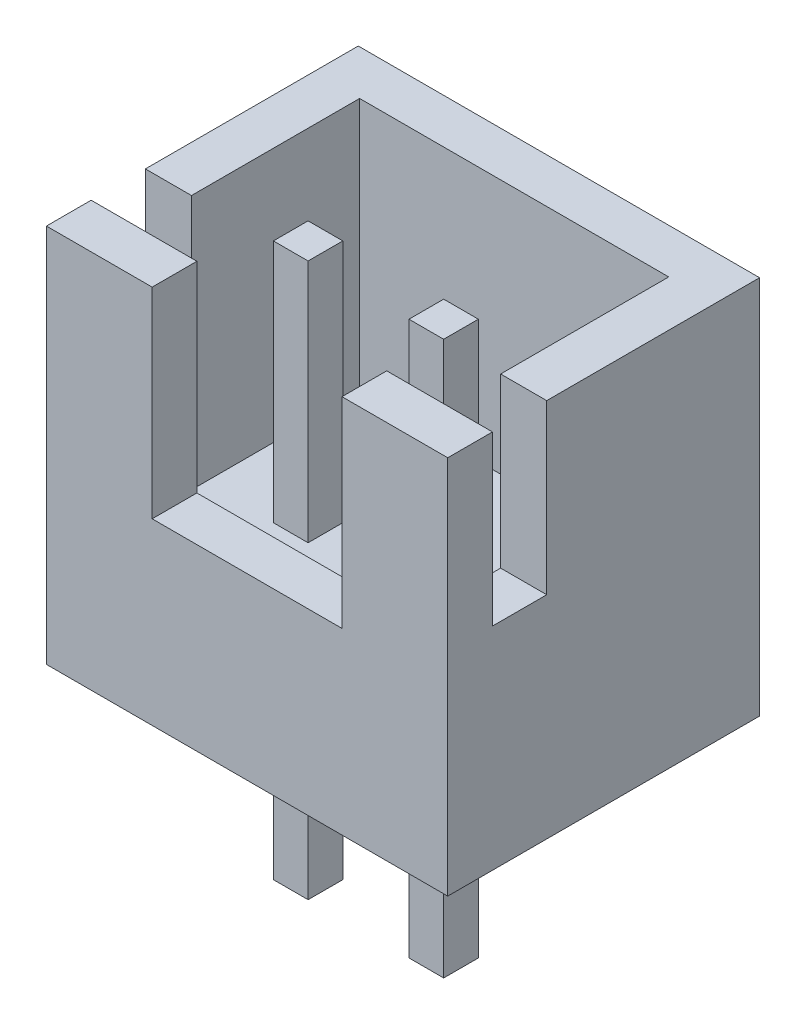
ISO-10303-21;
HEADER;
FILE_DESCRIPTION(('STEP AP214'),'2;1');
FILE_NAME('part.step','',(''),(''),'','','');
FILE_SCHEMA(('AUTOMOTIVE_DESIGN { 1 0 10303 214 1 1 1 1 }'));
ENDSEC;
DATA;
#1=APPLICATION_CONTEXT('core data for automotive mechanical design processes');
#2=APPLICATION_PROTOCOL_DEFINITION('international standard','automotive_design',2000,#1);
#3=PRODUCT_CONTEXT('',#1,'mechanical');
#4=PRODUCT('Part','Part','',(#3));
#5=PRODUCT_RELATED_PRODUCT_CATEGORY('part','',(#4));
#6=PRODUCT_DEFINITION_FORMATION('','',#4);
#7=PRODUCT_DEFINITION_CONTEXT('part definition',#1,'design');
#8=PRODUCT_DEFINITION('design','',#6,#7);
#9=PRODUCT_DEFINITION_SHAPE('','',#8);
#10=(LENGTH_UNIT() NAMED_UNIT(*) SI_UNIT(.MILLI.,.METRE.));
#11=(NAMED_UNIT(*) PLANE_ANGLE_UNIT() SI_UNIT($,.RADIAN.));
#12=(NAMED_UNIT(*) SI_UNIT($,.STERADIAN.) SOLID_ANGLE_UNIT());
#13=UNCERTAINTY_MEASURE_WITH_UNIT(LENGTH_MEASURE(1.E-05),#10,'distance_accuracy_value','');
#14=(GEOMETRIC_REPRESENTATION_CONTEXT(3) GLOBAL_UNCERTAINTY_ASSIGNED_CONTEXT((#13)) GLOBAL_UNIT_ASSIGNED_CONTEXT((#10,
#11,#12)) REPRESENTATION_CONTEXT('',''));
#15=CARTESIAN_POINT('',(0.,0.,0.));
#16=DIRECTION('',(0.,0.,1.));
#17=DIRECTION('',(1.,0.,0.));
#18=AXIS2_PLACEMENT_3D('',#15,#16,#17);
#19=CARTESIAN_POINT('',(0.93,7.705096679919,0.82));
#20=DIRECTION('',(0.,0.,-1.));
#21=DIRECTION('',(-1.,0.,0.));
#22=AXIS2_PLACEMENT_3D('',#19,#20,#21);
#23=PLANE('',#22);
#24=DIRECTION('',(-1.,0.,0.));
#25=VECTOR('',#24,1.);
#26=CARTESIAN_POINT('',(0.93,2.3,0.82));
#27=LINE('',#26,#25);
#28=CARTESIAN_POINT('',(1.57,2.3,0.82));
#29=VERTEX_POINT('',#28);
#30=CARTESIAN_POINT('',(0.93,2.3,0.82));
#31=VERTEX_POINT('',#30);
#32=EDGE_CURVE('E20',#29,#31,#27,.T.);
#33=ORIENTED_EDGE('',*,*,#32,.F.);
#34=DIRECTION('',(0.,1.,0.));
#35=VECTOR('',#34,1.);
#36=CARTESIAN_POINT('',(1.57,7.705096679919,0.82));
#37=LINE('',#36,#35);
#38=CARTESIAN_POINT('',(1.57,6.8,0.82));
#39=VERTEX_POINT('',#38);
#40=EDGE_CURVE('E242',#29,#39,#37,.T.);
#41=ORIENTED_EDGE('',*,*,#40,.T.);
#42=DIRECTION('',(1.,0.,0.));
#43=VECTOR('',#42,1.);
#44=CARTESIAN_POINT('',(0.,6.8,0.82));
#45=LINE('',#44,#43);
#46=CARTESIAN_POINT('',(0.93,6.8,0.82));
#47=VERTEX_POINT('',#46);
#48=EDGE_CURVE('E238',#39,#47,#45,.F.);
#49=ORIENTED_EDGE('',*,*,#48,.T.);
#50=DIRECTION('',(0.,1.,0.));
#51=VECTOR('',#50,1.);
#52=CARTESIAN_POINT('',(0.93,7.705096679919,0.82));
#53=LINE('',#52,#51);
#54=EDGE_CURVE('E240',#47,#31,#53,.F.);
#55=ORIENTED_EDGE('',*,*,#54,.T.);
#56=EDGE_LOOP('',(#33,#41,#49,#55));
#57=FACE_BOUND('',#56,.T.);
#58=ADVANCED_FACE('F17',(#57),#23,.F.);
#59=CARTESIAN_POINT('',(-1.57,7.705096679919,0.82));
#60=DIRECTION('',(0.,0.,-1.));
#61=DIRECTION('',(-1.,0.,0.));
#62=AXIS2_PLACEMENT_3D('',#59,#60,#61);
#63=PLANE('',#62);
#64=DIRECTION('',(-1.,0.,0.));
#65=VECTOR('',#64,1.);
#66=CARTESIAN_POINT('',(-1.57,2.3,0.82));
#67=LINE('',#66,#65);
#68=CARTESIAN_POINT('',(-0.93,2.3,0.82));
#69=VERTEX_POINT('',#68);
#70=CARTESIAN_POINT('',(-1.57,2.3,0.82));
#71=VERTEX_POINT('',#70);
#72=EDGE_CURVE('E248',#69,#71,#67,.T.);
#73=ORIENTED_EDGE('',*,*,#72,.F.);
#74=DIRECTION('',(0.,1.,0.));
#75=VECTOR('',#74,1.);
#76=CARTESIAN_POINT('',(-0.93,7.705096679919,0.82));
#77=LINE('',#76,#75);
#78=CARTESIAN_POINT('',(-0.93,6.8,0.82));
#79=VERTEX_POINT('',#78);
#80=EDGE_CURVE('E363',#69,#79,#77,.T.);
#81=ORIENTED_EDGE('',*,*,#80,.T.);
#82=DIRECTION('',(1.,0.,0.));
#83=VECTOR('',#82,1.);
#84=CARTESIAN_POINT('',(0.,6.8,0.82));
#85=LINE('',#84,#83);
#86=CARTESIAN_POINT('',(-1.57,6.8,0.82));
#87=VERTEX_POINT('',#86);
#88=EDGE_CURVE('E285',#79,#87,#85,.F.);
#89=ORIENTED_EDGE('',*,*,#88,.T.);
#90=DIRECTION('',(0.,1.,0.));
#91=VECTOR('',#90,1.);
#92=CARTESIAN_POINT('',(-1.57,7.705096679919,0.82));
#93=LINE('',#92,#91);
#94=EDGE_CURVE('E277',#87,#71,#93,.F.);
#95=ORIENTED_EDGE('',*,*,#94,.T.);
#96=EDGE_LOOP('',(#73,#81,#89,#95));
#97=FACE_BOUND('',#96,.T.);
#98=ADVANCED_FACE('F284',(#97),#63,.F.);
#99=CARTESIAN_POINT('',(0.,6.8,0.5));
#100=DIRECTION('',(0.,-1.,0.));
#101=DIRECTION('',(0.,0.,-1.));
#102=AXIS2_PLACEMENT_3D('',#99,#100,#101);
#103=PLANE('',#102);
#104=DIRECTION('',(0.,0.,1.));
#105=VECTOR('',#104,1.);
#106=CARTESIAN_POINT('',(1.57,6.8,0.82));
#107=LINE('',#106,#105);
#108=CARTESIAN_POINT('',(1.57,6.8,0.18));
#109=VERTEX_POINT('',#108);
#110=EDGE_CURVE('E295',#39,#109,#107,.F.);
#111=ORIENTED_EDGE('',*,*,#110,.T.);
#112=DIRECTION('',(1.,0.,0.));
#113=VECTOR('',#112,1.);
#114=CARTESIAN_POINT('',(0.93,6.8,0.18));
#115=LINE('',#114,#113);
#116=CARTESIAN_POINT('',(0.93,6.8,0.18));
#117=VERTEX_POINT('',#116);
#118=EDGE_CURVE('E258',#109,#117,#115,.F.);
#119=ORIENTED_EDGE('',*,*,#118,.T.);
#120=DIRECTION('',(0.,0.,-1.));
#121=VECTOR('',#120,1.);
#122=CARTESIAN_POINT('',(0.93,6.8,0.82));
#123=LINE('',#122,#121);
#124=EDGE_CURVE('E247',#117,#47,#123,.F.);
#125=ORIENTED_EDGE('',*,*,#124,.T.);
#126=ORIENTED_EDGE('',*,*,#48,.F.);
#127=EDGE_LOOP('',(#111,#119,#125,#126));
#128=FACE_BOUND('',#127,.T.);
#129=ADVANCED_FACE('F257',(#128),#103,.F.);
#130=CARTESIAN_POINT('',(0.93,7.705096679919,0.82));
#131=DIRECTION('',(1.,0.,0.));
#132=DIRECTION('',(0.,0.,-1.));
#133=AXIS2_PLACEMENT_3D('',#130,#131,#132);
#134=PLANE('',#133);
#135=DIRECTION('',(0.,0.,-1.));
#136=VECTOR('',#135,1.);
#137=CARTESIAN_POINT('',(0.93,2.3,0.82));
#138=LINE('',#137,#136);
#139=CARTESIAN_POINT('',(0.93,2.3,0.18));
#140=VERTEX_POINT('',#139);
#141=EDGE_CURVE('E254',#31,#140,#138,.T.);
#142=ORIENTED_EDGE('',*,*,#141,.F.);
#143=ORIENTED_EDGE('',*,*,#54,.F.);
#144=ORIENTED_EDGE('',*,*,#124,.F.);
#145=DIRECTION('',(0.,1.,0.));
#146=VECTOR('',#145,1.);
#147=CARTESIAN_POINT('',(0.93,7.705096679919,0.18));
#148=LINE('',#147,#146);
#149=EDGE_CURVE('E299',#117,#140,#148,.F.);
#150=ORIENTED_EDGE('',*,*,#149,.T.);
#151=EDGE_LOOP('',(#142,#143,#144,#150));
#152=FACE_BOUND('',#151,.T.);
#153=ADVANCED_FACE('F251',(#152),#134,.F.);
#154=CARTESIAN_POINT('',(1.57,7.705096679919,0.82));
#155=DIRECTION('',(-1.,0.,0.));
#156=DIRECTION('',(0.,0.,1.));
#157=AXIS2_PLACEMENT_3D('',#154,#155,#156);
#158=PLANE('',#157);
#159=DIRECTION('',(0.,0.,1.));
#160=VECTOR('',#159,1.);
#161=CARTESIAN_POINT('',(1.57,2.3,0.82));
#162=LINE('',#161,#160);
#163=CARTESIAN_POINT('',(1.57,2.3,0.18));
#164=VERTEX_POINT('',#163);
#165=EDGE_CURVE('E293',#164,#29,#162,.T.);
#166=ORIENTED_EDGE('',*,*,#165,.F.);
#167=DIRECTION('',(0.,1.,0.));
#168=VECTOR('',#167,1.);
#169=CARTESIAN_POINT('',(1.57,7.705096679919,0.18));
#170=LINE('',#169,#168);
#171=EDGE_CURVE('E301',#164,#109,#170,.T.);
#172=ORIENTED_EDGE('',*,*,#171,.T.);
#173=ORIENTED_EDGE('',*,*,#110,.F.);
#174=ORIENTED_EDGE('',*,*,#40,.F.);
#175=EDGE_LOOP('',(#166,#172,#173,#174));
#176=FACE_BOUND('',#175,.T.);
#177=ADVANCED_FACE('F666',(#176),#158,.F.);
#178=CARTESIAN_POINT('',(0.,6.8,0.5));
#179=DIRECTION('',(0.,-1.,0.));
#180=DIRECTION('',(0.,0.,-1.));
#181=AXIS2_PLACEMENT_3D('',#178,#179,#180);
#182=PLANE('',#181);
#183=DIRECTION('',(0.,0.,1.));
#184=VECTOR('',#183,1.);
#185=CARTESIAN_POINT('',(-0.93,6.8,0.82));
#186=LINE('',#185,#184);
#187=CARTESIAN_POINT('',(-0.93,6.8,0.18));
#188=VERTEX_POINT('',#187);
#189=EDGE_CURVE('E282',#79,#188,#186,.F.);
#190=ORIENTED_EDGE('',*,*,#189,.T.);
#191=DIRECTION('',(1.,0.,0.));
#192=VECTOR('',#191,1.);
#193=CARTESIAN_POINT('',(-1.57,6.8,0.18));
#194=LINE('',#193,#192);
#195=CARTESIAN_POINT('',(-1.57,6.8,0.18));
#196=VERTEX_POINT('',#195);
#197=EDGE_CURVE('E354',#188,#196,#194,.F.);
#198=ORIENTED_EDGE('',*,*,#197,.T.);
#199=DIRECTION('',(0.,0.,-1.));
#200=VECTOR('',#199,1.);
#201=CARTESIAN_POINT('',(-1.57,6.8,0.82));
#202=LINE('',#201,#200);
#203=EDGE_CURVE('E286',#196,#87,#202,.F.);
#204=ORIENTED_EDGE('',*,*,#203,.T.);
#205=ORIENTED_EDGE('',*,*,#88,.F.);
#206=EDGE_LOOP('',(#190,#198,#204,#205));
#207=FACE_BOUND('',#206,.T.);
#208=ADVANCED_FACE('F368',(#207),#182,.F.);
#209=CARTESIAN_POINT('',(-1.57,7.705096679919,0.82));
#210=DIRECTION('',(1.,0.,0.));
#211=DIRECTION('',(0.,0.,-1.));
#212=AXIS2_PLACEMENT_3D('',#209,#210,#211);
#213=PLANE('',#212);
#214=DIRECTION('',(0.,0.,-1.));
#215=VECTOR('',#214,1.);
#216=CARTESIAN_POINT('',(-1.57,2.3,0.82));
#217=LINE('',#216,#215);
#218=CARTESIAN_POINT('',(-1.57,2.3,0.18));
#219=VERTEX_POINT('',#218);
#220=EDGE_CURVE('E267',#71,#219,#217,.T.);
#221=ORIENTED_EDGE('',*,*,#220,.F.);
#222=ORIENTED_EDGE('',*,*,#94,.F.);
#223=ORIENTED_EDGE('',*,*,#203,.F.);
#224=DIRECTION('',(0.,1.,0.));
#225=VECTOR('',#224,1.);
#226=CARTESIAN_POINT('',(-1.57,7.705096679919,0.18));
#227=LINE('',#226,#225);
#228=EDGE_CURVE('E280',#196,#219,#227,.F.);
#229=ORIENTED_EDGE('',*,*,#228,.T.);
#230=EDGE_LOOP('',(#221,#222,#223,#229));
#231=FACE_BOUND('',#230,.T.);
#232=ADVANCED_FACE('F276',(#231),#213,.F.);
#233=CARTESIAN_POINT('',(-0.93,7.705096679919,0.82));
#234=DIRECTION('',(-1.,0.,0.));
#235=DIRECTION('',(0.,0.,1.));
#236=AXIS2_PLACEMENT_3D('',#233,#234,#235);
#237=PLANE('',#236);
#238=DIRECTION('',(0.,0.,1.));
#239=VECTOR('',#238,1.);
#240=CARTESIAN_POINT('',(-0.93,2.3,0.82));
#241=LINE('',#240,#239);
#242=CARTESIAN_POINT('',(-0.93,2.3,0.18));
#243=VERTEX_POINT('',#242);
#244=EDGE_CURVE('E269',#243,#69,#241,.T.);
#245=ORIENTED_EDGE('',*,*,#244,.F.);
#246=DIRECTION('',(0.,1.,0.));
#247=VECTOR('',#246,1.);
#248=CARTESIAN_POINT('',(-0.93,7.705096679919,0.18));
#249=LINE('',#248,#247);
#250=EDGE_CURVE('E350',#243,#188,#249,.T.);
#251=ORIENTED_EDGE('',*,*,#250,.T.);
#252=ORIENTED_EDGE('',*,*,#189,.F.);
#253=ORIENTED_EDGE('',*,*,#80,.F.);
#254=EDGE_LOOP('',(#245,#251,#252,#253));
#255=FACE_BOUND('',#254,.T.);
#256=ADVANCED_FACE('F371',(#255),#237,.F.);
#257=CARTESIAN_POINT('',(0.93,7.705096679919,0.82));
#258=DIRECTION('',(0.,0.,-1.));
#259=DIRECTION('',(-1.,0.,0.));
#260=AXIS2_PLACEMENT_3D('',#257,#258,#259);
#261=PLANE('',#260);
#262=DIRECTION('',(-1.,0.,0.));
#263=VECTOR('',#262,1.);
#264=CARTESIAN_POINT('',(0.93,0.,0.82));
#265=LINE('',#264,#263);
#266=CARTESIAN_POINT('',(0.93,0.,0.82));
#267=VERTEX_POINT('',#266);
#268=CARTESIAN_POINT('',(1.57,0.,0.82));
#269=VERTEX_POINT('',#268);
#270=EDGE_CURVE('E361',#267,#269,#265,.F.);
#271=ORIENTED_EDGE('',*,*,#270,.F.);
#272=DIRECTION('',(0.,1.,0.));
#273=VECTOR('',#272,1.);
#274=CARTESIAN_POINT('',(0.93,7.705096679919,0.82));
#275=LINE('',#274,#273);
#276=CARTESIAN_POINT('',(0.93,-3.4,0.82));
#277=VERTEX_POINT('',#276);
#278=EDGE_CURVE('E331',#267,#277,#275,.F.);
#279=ORIENTED_EDGE('',*,*,#278,.T.);
#280=DIRECTION('',(1.,0.,0.));
#281=VECTOR('',#280,1.);
#282=CARTESIAN_POINT('',(0.93,-3.4,0.82));
#283=LINE('',#282,#281);
#284=CARTESIAN_POINT('',(1.57,-3.4,0.82));
#285=VERTEX_POINT('',#284);
#286=EDGE_CURVE('E348',#285,#277,#283,.F.);
#287=ORIENTED_EDGE('',*,*,#286,.F.);
#288=DIRECTION('',(0.,1.,0.));
#289=VECTOR('',#288,1.);
#290=CARTESIAN_POINT('',(1.57,7.705096679919,0.82));
#291=LINE('',#290,#289);
#292=EDGE_CURVE('E342',#285,#269,#291,.T.);
#293=ORIENTED_EDGE('',*,*,#292,.T.);
#294=EDGE_LOOP('',(#271,#279,#287,#293));
#295=FACE_BOUND('',#294,.T.);
#296=ADVANCED_FACE('F505',(#295),#261,.F.);
#297=CARTESIAN_POINT('',(-1.57,7.705096679919,0.82));
#298=DIRECTION('',(0.,0.,-1.));
#299=DIRECTION('',(-1.,0.,0.));
#300=AXIS2_PLACEMENT_3D('',#297,#298,#299);
#301=PLANE('',#300);
#302=DIRECTION('',(-1.,0.,0.));
#303=VECTOR('',#302,1.);
#304=CARTESIAN_POINT('',(-1.57,0.,0.82));
#305=LINE('',#304,#303);
#306=CARTESIAN_POINT('',(-1.57,0.,0.82));
#307=VERTEX_POINT('',#306);
#308=CARTESIAN_POINT('',(-0.93,0.,0.82));
#309=VERTEX_POINT('',#308);
#310=EDGE_CURVE('E359',#307,#309,#305,.F.);
#311=ORIENTED_EDGE('',*,*,#310,.F.);
#312=DIRECTION('',(0.,1.,0.));
#313=VECTOR('',#312,1.);
#314=CARTESIAN_POINT('',(-1.57,7.705096679919,0.82));
#315=LINE('',#314,#313);
#316=CARTESIAN_POINT('',(-1.57,-3.4,0.82));
#317=VERTEX_POINT('',#316);
#318=EDGE_CURVE('E307',#307,#317,#315,.F.);
#319=ORIENTED_EDGE('',*,*,#318,.T.);
#320=DIRECTION('',(1.,0.,0.));
#321=VECTOR('',#320,1.);
#322=CARTESIAN_POINT('',(-1.57,-3.4,0.82));
#323=LINE('',#322,#321);
#324=CARTESIAN_POINT('',(-0.93,-3.4,0.82));
#325=VERTEX_POINT('',#324);
#326=EDGE_CURVE('E329',#325,#317,#323,.F.);
#327=ORIENTED_EDGE('',*,*,#326,.F.);
#328=DIRECTION('',(0.,1.,0.));
#329=VECTOR('',#328,1.);
#330=CARTESIAN_POINT('',(-0.93,7.705096679919,0.82));
#331=LINE('',#330,#329);
#332=EDGE_CURVE('E323',#325,#309,#331,.T.);
#333=ORIENTED_EDGE('',*,*,#332,.T.);
#334=EDGE_LOOP('',(#311,#319,#327,#333));
#335=FACE_BOUND('',#334,.T.);
#336=ADVANCED_FACE('F385',(#335),#301,.F.);
#337=CARTESIAN_POINT('',(0.93,7.705096679919,0.18));
#338=DIRECTION('',(0.,0.,1.));
#339=DIRECTION('',(1.,0.,0.));
#340=AXIS2_PLACEMENT_3D('',#337,#338,#339);
#341=PLANE('',#340);
#342=DIRECTION('',(1.,0.,0.));
#343=VECTOR('',#342,1.);
#344=CARTESIAN_POINT('',(-2.85,2.3,0.18));
#345=LINE('',#344,#343);
#346=EDGE_CURVE('E298',#164,#140,#345,.F.);
#347=ORIENTED_EDGE('',*,*,#346,.T.);
#348=ORIENTED_EDGE('',*,*,#149,.F.);
#349=ORIENTED_EDGE('',*,*,#118,.F.);
#350=ORIENTED_EDGE('',*,*,#171,.F.);
#351=EDGE_LOOP('',(#347,#348,#349,#350));
#352=FACE_BOUND('',#351,.T.);
#353=ADVANCED_FACE('F304',(#352),#341,.F.);
#354=CARTESIAN_POINT('',(-1.57,7.705096679919,0.18));
#355=DIRECTION('',(0.,0.,1.));
#356=DIRECTION('',(1.,0.,0.));
#357=AXIS2_PLACEMENT_3D('',#354,#355,#356);
#358=PLANE('',#357);
#359=DIRECTION('',(1.,0.,0.));
#360=VECTOR('',#359,1.);
#361=CARTESIAN_POINT('',(-2.85,2.3,0.18));
#362=LINE('',#361,#360);
#363=EDGE_CURVE('E306',#243,#219,#362,.F.);
#364=ORIENTED_EDGE('',*,*,#363,.T.);
#365=ORIENTED_EDGE('',*,*,#228,.F.);
#366=ORIENTED_EDGE('',*,*,#197,.F.);
#367=ORIENTED_EDGE('',*,*,#250,.F.);
#368=EDGE_LOOP('',(#364,#365,#366,#367));
#369=FACE_BOUND('',#368,.T.);
#370=ADVANCED_FACE('F373',(#369),#358,.F.);
#371=CARTESIAN_POINT('',(0.93,-3.4,0.18));
#372=DIRECTION('',(0.,-1.,0.));
#373=DIRECTION('',(0.,0.,-1.));
#374=AXIS2_PLACEMENT_3D('',#371,#372,#373);
#375=PLANE('',#374);
#376=DIRECTION('',(0.,0.,1.));
#377=VECTOR('',#376,1.);
#378=CARTESIAN_POINT('',(1.57,-3.4,0.82));
#379=LINE('',#378,#377);
#380=CARTESIAN_POINT('',(1.57,-3.4,0.18));
#381=VERTEX_POINT('',#380);
#382=EDGE_CURVE('E345',#381,#285,#379,.T.);
#383=ORIENTED_EDGE('',*,*,#382,.T.);
#384=ORIENTED_EDGE('',*,*,#286,.T.);
#385=DIRECTION('',(0.,0.,-1.));
#386=VECTOR('',#385,1.);
#387=CARTESIAN_POINT('',(0.93,-3.4,0.82));
#388=LINE('',#387,#386);
#389=CARTESIAN_POINT('',(0.93,-3.4,0.18));
#390=VERTEX_POINT('',#389);
#391=EDGE_CURVE('E337',#277,#390,#388,.T.);
#392=ORIENTED_EDGE('',*,*,#391,.T.);
#393=DIRECTION('',(1.,0.,0.));
#394=VECTOR('',#393,1.);
#395=CARTESIAN_POINT('',(0.93,-3.4,0.18));
#396=LINE('',#395,#394);
#397=EDGE_CURVE('E517',#390,#381,#396,.T.);
#398=ORIENTED_EDGE('',*,*,#397,.T.);
#399=EDGE_LOOP('',(#383,#384,#392,#398));
#400=FACE_BOUND('',#399,.T.);
#401=ADVANCED_FACE('F375',(#400),#375,.T.);
#402=CARTESIAN_POINT('',(1.57,7.705096679919,0.82));
#403=DIRECTION('',(-1.,0.,0.));
#404=DIRECTION('',(0.,0.,1.));
#405=AXIS2_PLACEMENT_3D('',#402,#403,#404);
#406=PLANE('',#405);
#407=DIRECTION('',(0.,0.,1.));
#408=VECTOR('',#407,1.);
#409=CARTESIAN_POINT('',(1.57,0.,0.82));
#410=LINE('',#409,#408);
#411=CARTESIAN_POINT('',(1.57,0.,0.18));
#412=VERTEX_POINT('',#411);
#413=EDGE_CURVE('E340',#269,#412,#410,.F.);
#414=ORIENTED_EDGE('',*,*,#413,.F.);
#415=ORIENTED_EDGE('',*,*,#292,.F.);
#416=ORIENTED_EDGE('',*,*,#382,.F.);
#417=DIRECTION('',(0.,1.,0.));
#418=VECTOR('',#417,1.);
#419=CARTESIAN_POINT('',(1.57,7.705096679919,0.18));
#420=LINE('',#419,#418);
#421=EDGE_CURVE('E500',#381,#412,#420,.T.);
#422=ORIENTED_EDGE('',*,*,#421,.T.);
#423=EDGE_LOOP('',(#414,#415,#416,#422));
#424=FACE_BOUND('',#423,.T.);
#425=ADVANCED_FACE('F382',(#424),#406,.F.);
#426=CARTESIAN_POINT('',(0.93,7.705096679919,0.82));
#427=DIRECTION('',(1.,0.,0.));
#428=DIRECTION('',(0.,0.,-1.));
#429=AXIS2_PLACEMENT_3D('',#426,#427,#428);
#430=PLANE('',#429);
#431=DIRECTION('',(0.,0.,-1.));
#432=VECTOR('',#431,1.);
#433=CARTESIAN_POINT('',(0.93,0.,0.82));
#434=LINE('',#433,#432);
#435=CARTESIAN_POINT('',(0.93,0.,0.18));
#436=VERTEX_POINT('',#435);
#437=EDGE_CURVE('E334',#436,#267,#434,.F.);
#438=ORIENTED_EDGE('',*,*,#437,.F.);
#439=DIRECTION('',(0.,1.,0.));
#440=VECTOR('',#439,1.);
#441=CARTESIAN_POINT('',(0.93,7.705096679919,0.18));
#442=LINE('',#441,#440);
#443=EDGE_CURVE('E511',#436,#390,#442,.F.);
#444=ORIENTED_EDGE('',*,*,#443,.T.);
#445=ORIENTED_EDGE('',*,*,#391,.F.);
#446=ORIENTED_EDGE('',*,*,#278,.F.);
#447=EDGE_LOOP('',(#438,#444,#445,#446));
#448=FACE_BOUND('',#447,.T.);
#449=ADVANCED_FACE('F487',(#448),#430,.F.);
#450=CARTESIAN_POINT('',(-1.57,-3.4,0.18));
#451=DIRECTION('',(0.,-1.,0.));
#452=DIRECTION('',(0.,0.,-1.));
#453=AXIS2_PLACEMENT_3D('',#450,#451,#452);
#454=PLANE('',#453);
#455=DIRECTION('',(0.,0.,1.));
#456=VECTOR('',#455,1.);
#457=CARTESIAN_POINT('',(-0.93,-3.4,0.82));
#458=LINE('',#457,#456);
#459=CARTESIAN_POINT('',(-0.93,-3.4,0.18));
#460=VERTEX_POINT('',#459);
#461=EDGE_CURVE('E326',#460,#325,#458,.T.);
#462=ORIENTED_EDGE('',*,*,#461,.T.);
#463=ORIENTED_EDGE('',*,*,#326,.T.);
#464=DIRECTION('',(0.,0.,-1.));
#465=VECTOR('',#464,1.);
#466=CARTESIAN_POINT('',(-1.57,-3.4,0.82));
#467=LINE('',#466,#465);
#468=CARTESIAN_POINT('',(-1.57,-3.4,0.18));
#469=VERTEX_POINT('',#468);
#470=EDGE_CURVE('E318',#317,#469,#467,.T.);
#471=ORIENTED_EDGE('',*,*,#470,.T.);
#472=DIRECTION('',(1.,0.,0.));
#473=VECTOR('',#472,1.);
#474=CARTESIAN_POINT('',(-1.57,-3.4,0.18));
#475=LINE('',#474,#473);
#476=EDGE_CURVE('E512',#469,#460,#475,.T.);
#477=ORIENTED_EDGE('',*,*,#476,.T.);
#478=EDGE_LOOP('',(#462,#463,#471,#477));
#479=FACE_BOUND('',#478,.T.);
#480=ADVANCED_FACE('F483',(#479),#454,.T.);
#481=CARTESIAN_POINT('',(-0.93,7.705096679919,0.82));
#482=DIRECTION('',(-1.,0.,0.));
#483=DIRECTION('',(0.,0.,1.));
#484=AXIS2_PLACEMENT_3D('',#481,#482,#483);
#485=PLANE('',#484);
#486=DIRECTION('',(0.,0.,1.));
#487=VECTOR('',#486,1.);
#488=CARTESIAN_POINT('',(-0.93,0.,0.82));
#489=LINE('',#488,#487);
#490=CARTESIAN_POINT('',(-0.93,0.,0.18));
#491=VERTEX_POINT('',#490);
#492=EDGE_CURVE('E321',#309,#491,#489,.F.);
#493=ORIENTED_EDGE('',*,*,#492,.F.);
#494=ORIENTED_EDGE('',*,*,#332,.F.);
#495=ORIENTED_EDGE('',*,*,#461,.F.);
#496=DIRECTION('',(0.,1.,0.));
#497=VECTOR('',#496,1.);
#498=CARTESIAN_POINT('',(-0.93,7.705096679919,0.18));
#499=LINE('',#498,#497);
#500=EDGE_CURVE('E515',#460,#491,#499,.T.);
#501=ORIENTED_EDGE('',*,*,#500,.T.);
#502=EDGE_LOOP('',(#493,#494,#495,#501));
#503=FACE_BOUND('',#502,.T.);
#504=ADVANCED_FACE('F479',(#503),#485,.F.);
#505=CARTESIAN_POINT('',(-1.57,7.705096679919,0.82));
#506=DIRECTION('',(1.,0.,0.));
#507=DIRECTION('',(0.,0.,-1.));
#508=AXIS2_PLACEMENT_3D('',#505,#506,#507);
#509=PLANE('',#508);
#510=DIRECTION('',(0.,0.,-1.));
#511=VECTOR('',#510,1.);
#512=CARTESIAN_POINT('',(-1.57,0.,0.82));
#513=LINE('',#512,#511);
#514=CARTESIAN_POINT('',(-1.57,0.,0.18));
#515=VERTEX_POINT('',#514);
#516=EDGE_CURVE('E312',#515,#307,#513,.F.);
#517=ORIENTED_EDGE('',*,*,#516,.F.);
#518=DIRECTION('',(0.,1.,0.));
#519=VECTOR('',#518,1.);
#520=CARTESIAN_POINT('',(-1.57,7.705096679919,0.18));
#521=LINE('',#520,#519);
#522=EDGE_CURVE('E641',#515,#469,#521,.F.);
#523=ORIENTED_EDGE('',*,*,#522,.T.);
#524=ORIENTED_EDGE('',*,*,#470,.F.);
#525=ORIENTED_EDGE('',*,*,#318,.F.);
#526=EDGE_LOOP('',(#517,#523,#524,#525));
#527=FACE_BOUND('',#526,.T.);
#528=ADVANCED_FACE('F476',(#527),#509,.F.);
#529=CARTESIAN_POINT('',(-2.85,2.3,-2.05));
#530=DIRECTION('',(0.,-1.,0.));
#531=DIRECTION('',(0.,0.,-1.));
#532=AXIS2_PLACEMENT_3D('',#529,#530,#531);
#533=PLANE('',#532);
#534=ORIENTED_EDGE('',*,*,#244,.T.);
#535=ORIENTED_EDGE('',*,*,#72,.T.);
#536=ORIENTED_EDGE('',*,*,#220,.T.);
#537=ORIENTED_EDGE('',*,*,#363,.F.);
#538=EDGE_LOOP('',(#534,#535,#536,#537));
#539=FACE_BOUND('',#538,.T.);
#540=DIRECTION('',(1.,0.,0.));
#541=VECTOR('',#540,1.);
#542=CARTESIAN_POINT('',(3.7,2.3,2.05));
#543=LINE('',#542,#541);
#544=CARTESIAN_POINT('',(-2.85,2.3,2.05));
#545=VERTEX_POINT('',#544);
#546=CARTESIAN_POINT('',(2.85,2.3,2.05));
#547=VERTEX_POINT('',#546);
#548=EDGE_CURVE('E605',#545,#547,#543,.T.);
#549=ORIENTED_EDGE('',*,*,#548,.T.);
#550=DIRECTION('',(0.,0.,-1.));
#551=VECTOR('',#550,1.);
#552=CARTESIAN_POINT('',(2.85,2.3,2.05));
#553=LINE('',#552,#551);
#554=CARTESIAN_POINT('',(2.85,2.3,-2.05));
#555=VERTEX_POINT('',#554);
#556=EDGE_CURVE('E630',#547,#555,#553,.T.);
#557=ORIENTED_EDGE('',*,*,#556,.T.);
#558=DIRECTION('',(-1.,0.,0.));
#559=VECTOR('',#558,1.);
#560=CARTESIAN_POINT('',(-2.85,2.3,-2.05));
#561=LINE('',#560,#559);
#562=CARTESIAN_POINT('',(-2.85,2.3,-2.05));
#563=VERTEX_POINT('',#562);
#564=EDGE_CURVE('E625',#555,#563,#561,.T.);
#565=ORIENTED_EDGE('',*,*,#564,.T.);
#566=DIRECTION('',(0.,0.,1.));
#567=VECTOR('',#566,1.);
#568=CARTESIAN_POINT('',(-2.85,2.3,2.05));
#569=LINE('',#568,#567);
#570=EDGE_CURVE('E620',#563,#545,#569,.T.);
#571=ORIENTED_EDGE('',*,*,#570,.T.);
#572=EDGE_LOOP('',(#549,#557,#565,#571));
#573=FACE_BOUND('',#572,.T.);
#574=ORIENTED_EDGE('',*,*,#165,.T.);
#575=ORIENTED_EDGE('',*,*,#32,.T.);
#576=ORIENTED_EDGE('',*,*,#141,.T.);
#577=ORIENTED_EDGE('',*,*,#346,.F.);
#578=EDGE_LOOP('',(#574,#575,#576,#577));
#579=FACE_BOUND('',#578,.T.);
#580=ADVANCED_FACE('F264',(#539,#573,#579),#533,.F.);
#581=CARTESIAN_POINT('',(3.7,7.,2.875));
#582=DIRECTION('',(0.,-1.,0.));
#583=DIRECTION('',(0.,0.,-1.));
#584=AXIS2_PLACEMENT_3D('',#581,#582,#583);
#585=PLANE('',#584);
#586=DIRECTION('',(0.,0.,1.));
#587=VECTOR('',#586,1.);
#588=CARTESIAN_POINT('',(1.75,7.,-3.043132631299));
#589=LINE('',#588,#587);
#590=CARTESIAN_POINT('',(1.75,7.,2.05));
#591=VERTEX_POINT('',#590);
#592=CARTESIAN_POINT('',(1.75,7.,2.875));
#593=VERTEX_POINT('',#592);
#594=EDGE_CURVE('E531',#591,#593,#589,.T.);
#595=ORIENTED_EDGE('',*,*,#594,.T.);
#596=DIRECTION('',(-1.,0.,0.));
#597=VECTOR('',#596,1.);
#598=CARTESIAN_POINT('',(3.7,7.,2.875));
#599=LINE('',#598,#597);
#600=CARTESIAN_POINT('',(3.7,7.,2.875));
#601=VERTEX_POINT('',#600);
#602=EDGE_CURVE('E544',#593,#601,#599,.F.);
#603=ORIENTED_EDGE('',*,*,#602,.T.);
#604=DIRECTION('',(0.,0.,-1.));
#605=VECTOR('',#604,1.);
#606=CARTESIAN_POINT('',(3.7,7.,2.875));
#607=LINE('',#606,#605);
#608=CARTESIAN_POINT('',(3.7,7.,2.05));
#609=VERTEX_POINT('',#608);
#610=EDGE_CURVE('E309',#609,#601,#607,.F.);
#611=ORIENTED_EDGE('',*,*,#610,.F.);
#612=DIRECTION('',(1.,0.,0.));
#613=VECTOR('',#612,1.);
#614=CARTESIAN_POINT('',(3.7,7.,2.05));
#615=LINE('',#614,#613);
#616=EDGE_CURVE('E598',#609,#591,#615,.F.);
#617=ORIENTED_EDGE('',*,*,#616,.T.);
#618=EDGE_LOOP('',(#595,#603,#611,#617));
#619=FACE_BOUND('',#618,.T.);
#620=ADVANCED_FACE('F469',(#619),#585,.F.);
#621=CARTESIAN_POINT('',(1.75,7.,-3.043132631299));
#622=DIRECTION('',(1.,0.,0.));
#623=DIRECTION('',(0.,1.,0.));
#624=AXIS2_PLACEMENT_3D('',#621,#622,#623);
#625=PLANE('',#624);
#626=DIRECTION('',(0.,0.,1.));
#627=VECTOR('',#626,1.);
#628=CARTESIAN_POINT('',(1.75,3.3,-3.043132631299));
#629=LINE('',#628,#627);
#630=CARTESIAN_POINT('',(1.75,3.3,2.05));
#631=VERTEX_POINT('',#630);
#632=CARTESIAN_POINT('',(1.75,3.3,2.875));
#633=VERTEX_POINT('',#632);
#634=EDGE_CURVE('E528',#631,#633,#629,.T.);
#635=ORIENTED_EDGE('',*,*,#634,.T.);
#636=DIRECTION('',(0.,1.,0.));
#637=VECTOR('',#636,1.);
#638=CARTESIAN_POINT('',(1.75,0.,2.875));
#639=LINE('',#638,#637);
#640=EDGE_CURVE('E547',#633,#593,#639,.T.);
#641=ORIENTED_EDGE('',*,*,#640,.T.);
#642=ORIENTED_EDGE('',*,*,#594,.F.);
#643=DIRECTION('',(0.,-1.,0.));
#644=VECTOR('',#643,1.);
#645=CARTESIAN_POINT('',(1.75,7.,2.05));
#646=LINE('',#645,#644);
#647=EDGE_CURVE('E595',#591,#631,#646,.T.);
#648=ORIENTED_EDGE('',*,*,#647,.T.);
#649=EDGE_LOOP('',(#635,#641,#642,#648));
#650=FACE_BOUND('',#649,.T.);
#651=ADVANCED_FACE('F465',(#650),#625,.F.);
#652=CARTESIAN_POINT('',(-1.75,3.3,-3.043132631299));
#653=DIRECTION('',(0.,-1.,0.));
#654=DIRECTION('',(1.,0.,0.));
#655=AXIS2_PLACEMENT_3D('',#652,#653,#654);
#656=PLANE('',#655);
#657=DIRECTION('',(0.,0.,1.));
#658=VECTOR('',#657,1.);
#659=CARTESIAN_POINT('',(-1.75,3.3,-3.043132631299));
#660=LINE('',#659,#658);
#661=CARTESIAN_POINT('',(-1.75,3.3,2.05));
#662=VERTEX_POINT('',#661);
#663=CARTESIAN_POINT('',(-1.75,3.3,2.875));
#664=VERTEX_POINT('',#663);
#665=EDGE_CURVE('E526',#662,#664,#660,.T.);
#666=ORIENTED_EDGE('',*,*,#665,.T.);
#667=DIRECTION('',(-1.,0.,0.));
#668=VECTOR('',#667,1.);
#669=CARTESIAN_POINT('',(3.7,3.3,2.875));
#670=LINE('',#669,#668);
#671=EDGE_CURVE('E611',#664,#633,#670,.F.);
#672=ORIENTED_EDGE('',*,*,#671,.T.);
#673=ORIENTED_EDGE('',*,*,#634,.F.);
#674=DIRECTION('',(1.,0.,0.));
#675=VECTOR('',#674,1.);
#676=CARTESIAN_POINT('',(3.7,3.3,2.05));
#677=LINE('',#676,#675);
#678=EDGE_CURVE('E592',#631,#662,#677,.F.);
#679=ORIENTED_EDGE('',*,*,#678,.T.);
#680=EDGE_LOOP('',(#666,#672,#673,#679));
#681=FACE_BOUND('',#680,.T.);
#682=ADVANCED_FACE('F461',(#681),#656,.F.);
#683=CARTESIAN_POINT('',(-1.75,7.,-3.043132631299));
#684=DIRECTION('',(-1.,0.,0.));
#685=DIRECTION('',(0.,-1.,0.));
#686=AXIS2_PLACEMENT_3D('',#683,#684,#685);
#687=PLANE('',#686);
#688=DIRECTION('',(0.,0.,-1.));
#689=VECTOR('',#688,1.);
#690=CARTESIAN_POINT('',(-1.75,7.,2.875));
#691=LINE('',#690,#689);
#692=CARTESIAN_POINT('',(-1.75,7.,2.05));
#693=VERTEX_POINT('',#692);
#694=CARTESIAN_POINT('',(-1.75,7.,2.875));
#695=VERTEX_POINT('',#694);
#696=EDGE_CURVE('E522',#693,#695,#691,.F.);
#697=ORIENTED_EDGE('',*,*,#696,.T.);
#698=DIRECTION('',(0.,1.,0.));
#699=VECTOR('',#698,1.);
#700=CARTESIAN_POINT('',(-1.75,0.,2.875));
#701=LINE('',#700,#699);
#702=EDGE_CURVE('E614',#695,#664,#701,.F.);
#703=ORIENTED_EDGE('',*,*,#702,.T.);
#704=ORIENTED_EDGE('',*,*,#665,.F.);
#705=DIRECTION('',(0.,-1.,0.));
#706=VECTOR('',#705,1.);
#707=CARTESIAN_POINT('',(-1.75,7.,2.05));
#708=LINE('',#707,#706);
#709=EDGE_CURVE('E589',#662,#693,#708,.F.);
#710=ORIENTED_EDGE('',*,*,#709,.T.);
#711=EDGE_LOOP('',(#697,#703,#704,#710));
#712=FACE_BOUND('',#711,.T.);
#713=ADVANCED_FACE('F457',(#712),#687,.F.);
#714=CARTESIAN_POINT('',(3.7,7.,2.875));
#715=DIRECTION('',(0.,-1.,0.));
#716=DIRECTION('',(0.,0.,-1.));
#717=AXIS2_PLACEMENT_3D('',#714,#715,#716);
#718=PLANE('',#717);
#719=ORIENTED_EDGE('',*,*,#696,.F.);
#720=DIRECTION('',(1.,0.,0.));
#721=VECTOR('',#720,1.);
#722=CARTESIAN_POINT('',(3.7,7.,2.05));
#723=LINE('',#722,#721);
#724=CARTESIAN_POINT('',(-3.7,7.,2.05));
#725=VERTEX_POINT('',#724);
#726=EDGE_CURVE('E586',#693,#725,#723,.F.);
#727=ORIENTED_EDGE('',*,*,#726,.T.);
#728=DIRECTION('',(0.,0.,-1.));
#729=VECTOR('',#728,1.);
#730=CARTESIAN_POINT('',(-3.7,7.,2.875));
#731=LINE('',#730,#729);
#732=CARTESIAN_POINT('',(-3.7,7.,2.875));
#733=VERTEX_POINT('',#732);
#734=EDGE_CURVE('E524',#733,#725,#731,.T.);
#735=ORIENTED_EDGE('',*,*,#734,.F.);
#736=DIRECTION('',(-1.,0.,0.));
#737=VECTOR('',#736,1.);
#738=CARTESIAN_POINT('',(3.7,7.,2.875));
#739=LINE('',#738,#737);
#740=EDGE_CURVE('E546',#733,#695,#739,.F.);
#741=ORIENTED_EDGE('',*,*,#740,.T.);
#742=EDGE_LOOP('',(#719,#727,#735,#741));
#743=FACE_BOUND('',#742,.T.);
#744=ADVANCED_FACE('F453',(#743),#718,.F.);
#745=CARTESIAN_POINT('',(0.93,7.705096679919,0.18));
#746=DIRECTION('',(0.,0.,1.));
#747=DIRECTION('',(1.,0.,0.));
#748=AXIS2_PLACEMENT_3D('',#745,#746,#747);
#749=PLANE('',#748);
#750=DIRECTION('',(1.,0.,0.));
#751=VECTOR('',#750,1.);
#752=CARTESIAN_POINT('',(3.7,0.,0.18));
#753=LINE('',#752,#751);
#754=EDGE_CURVE('E572',#436,#412,#753,.T.);
#755=ORIENTED_EDGE('',*,*,#754,.T.);
#756=ORIENTED_EDGE('',*,*,#421,.F.);
#757=ORIENTED_EDGE('',*,*,#397,.F.);
#758=ORIENTED_EDGE('',*,*,#443,.F.);
#759=EDGE_LOOP('',(#755,#756,#757,#758));
#760=FACE_BOUND('',#759,.T.);
#761=ADVANCED_FACE('F449',(#760),#749,.F.);
#762=CARTESIAN_POINT('',(-1.57,7.705096679919,0.18));
#763=DIRECTION('',(0.,0.,1.));
#764=DIRECTION('',(1.,0.,0.));
#765=AXIS2_PLACEMENT_3D('',#762,#763,#764);
#766=PLANE('',#765);
#767=DIRECTION('',(1.,0.,0.));
#768=VECTOR('',#767,1.);
#769=CARTESIAN_POINT('',(3.7,0.,0.18));
#770=LINE('',#769,#768);
#771=EDGE_CURVE('E568',#515,#491,#770,.T.);
#772=ORIENTED_EDGE('',*,*,#771,.T.);
#773=ORIENTED_EDGE('',*,*,#500,.F.);
#774=ORIENTED_EDGE('',*,*,#476,.F.);
#775=ORIENTED_EDGE('',*,*,#522,.F.);
#776=EDGE_LOOP('',(#772,#773,#774,#775));
#777=FACE_BOUND('',#776,.T.);
#778=ADVANCED_FACE('F445',(#777),#766,.F.);
#779=CARTESIAN_POINT('',(3.7,3.9,2.05));
#780=DIRECTION('',(0.,-1.,0.));
#781=DIRECTION('',(0.,0.,-1.));
#782=AXIS2_PLACEMENT_3D('',#779,#780,#781);
#783=PLANE('',#782);
#784=DIRECTION('',(0.,0.,-1.));
#785=VECTOR('',#784,1.);
#786=CARTESIAN_POINT('',(2.85,3.9,2.05));
#787=LINE('',#786,#785);
#788=CARTESIAN_POINT('',(2.85,3.9,1.05));
#789=VERTEX_POINT('',#788);
#790=CARTESIAN_POINT('',(2.85,3.9,2.05));
#791=VERTEX_POINT('',#790);
#792=EDGE_CURVE('E632',#789,#791,#787,.F.);
#793=ORIENTED_EDGE('',*,*,#792,.T.);
#794=DIRECTION('',(1.,0.,0.));
#795=VECTOR('',#794,1.);
#796=CARTESIAN_POINT('',(3.7,3.9,2.05));
#797=LINE('',#796,#795);
#798=CARTESIAN_POINT('',(3.7,3.9,2.05));
#799=VERTEX_POINT('',#798);
#800=EDGE_CURVE('E600',#791,#799,#797,.T.);
#801=ORIENTED_EDGE('',*,*,#800,.T.);
#802=DIRECTION('',(0.,0.,1.));
#803=VECTOR('',#802,1.);
#804=CARTESIAN_POINT('',(3.7,3.9,2.875));
#805=LINE('',#804,#803);
#806=CARTESIAN_POINT('',(3.7,3.9,1.05));
#807=VERTEX_POINT('',#806);
#808=EDGE_CURVE('E564',#799,#807,#805,.F.);
#809=ORIENTED_EDGE('',*,*,#808,.T.);
#810=DIRECTION('',(-1.,0.,0.));
#811=VECTOR('',#810,1.);
#812=CARTESIAN_POINT('',(3.7,3.9,1.05));
#813=LINE('',#812,#811);
#814=EDGE_CURVE('E639',#807,#789,#813,.T.);
#815=ORIENTED_EDGE('',*,*,#814,.T.);
#816=EDGE_LOOP('',(#793,#801,#809,#815));
#817=FACE_BOUND('',#816,.T.);
#818=ADVANCED_FACE('F441',(#817),#783,.F.);
#819=CARTESIAN_POINT('',(3.7,3.9,1.05));
#820=DIRECTION('',(0.,0.,-1.));
#821=DIRECTION('',(-1.,0.,0.));
#822=AXIS2_PLACEMENT_3D('',#819,#820,#821);
#823=PLANE('',#822);
#824=DIRECTION('',(0.,1.,0.));
#825=VECTOR('',#824,1.);
#826=CARTESIAN_POINT('',(2.85,2.3,1.05));
#827=LINE('',#826,#825);
#828=CARTESIAN_POINT('',(2.85,7.,1.05));
#829=VERTEX_POINT('',#828);
#830=EDGE_CURVE('E634',#829,#789,#827,.F.);
#831=ORIENTED_EDGE('',*,*,#830,.T.);
#832=ORIENTED_EDGE('',*,*,#814,.F.);
#833=DIRECTION('',(0.,1.,0.));
#834=VECTOR('',#833,1.);
#835=CARTESIAN_POINT('',(3.7,7.,1.05));
#836=LINE('',#835,#834);
#837=CARTESIAN_POINT('',(3.7,7.,1.05));
#838=VERTEX_POINT('',#837);
#839=EDGE_CURVE('E558',#807,#838,#836,.T.);
#840=ORIENTED_EDGE('',*,*,#839,.T.);
#841=DIRECTION('',(-1.,0.,0.));
#842=VECTOR('',#841,1.);
#843=CARTESIAN_POINT('',(3.7,7.,1.05));
#844=LINE('',#843,#842);
#845=EDGE_CURVE('E637',#829,#838,#844,.F.);
#846=ORIENTED_EDGE('',*,*,#845,.F.);
#847=EDGE_LOOP('',(#831,#832,#840,#846));
#848=FACE_BOUND('',#847,.T.);
#849=ADVANCED_FACE('F437',(#848),#823,.F.);
#850=CARTESIAN_POINT('',(2.85,2.3,2.05));
#851=DIRECTION('',(1.,0.,0.));
#852=DIRECTION('',(0.,0.,-1.));
#853=AXIS2_PLACEMENT_3D('',#850,#851,#852);
#854=PLANE('',#853);
#855=DIRECTION('',(0.,1.,0.));
#856=VECTOR('',#855,1.);
#857=CARTESIAN_POINT('',(2.85,2.3,-2.05));
#858=LINE('',#857,#856);
#859=CARTESIAN_POINT('',(2.85,7.,-2.05));
#860=VERTEX_POINT('',#859);
#861=EDGE_CURVE('E627',#860,#555,#858,.F.);
#862=ORIENTED_EDGE('',*,*,#861,.T.);
#863=ORIENTED_EDGE('',*,*,#556,.F.);
#864=DIRECTION('',(0.,-1.,0.));
#865=VECTOR('',#864,1.);
#866=CARTESIAN_POINT('',(2.85,7.,2.05));
#867=LINE('',#866,#865);
#868=EDGE_CURVE('E602',#547,#791,#867,.F.);
#869=ORIENTED_EDGE('',*,*,#868,.T.);
#870=ORIENTED_EDGE('',*,*,#792,.F.);
#871=ORIENTED_EDGE('',*,*,#830,.F.);
#872=DIRECTION('',(0.,0.,-1.));
#873=VECTOR('',#872,1.);
#874=CARTESIAN_POINT('',(2.85,7.,1.05));
#875=LINE('',#874,#873);
#876=EDGE_CURVE('E556',#829,#860,#875,.T.);
#877=ORIENTED_EDGE('',*,*,#876,.T.);
#878=EDGE_LOOP('',(#862,#863,#869,#870,#871,#877));
#879=FACE_BOUND('',#878,.T.);
#880=ADVANCED_FACE('F433',(#879),#854,.F.);
#881=CARTESIAN_POINT('',(-2.85,2.3,-2.05));
#882=DIRECTION('',(0.,0.,-1.));
#883=DIRECTION('',(-1.,0.,0.));
#884=AXIS2_PLACEMENT_3D('',#881,#882,#883);
#885=PLANE('',#884);
#886=DIRECTION('',(0.,1.,0.));
#887=VECTOR('',#886,1.);
#888=CARTESIAN_POINT('',(-2.85,2.3,-2.05));
#889=LINE('',#888,#887);
#890=CARTESIAN_POINT('',(-2.85,7.,-2.05));
#891=VERTEX_POINT('',#890);
#892=EDGE_CURVE('E622',#891,#563,#889,.F.);
#893=ORIENTED_EDGE('',*,*,#892,.T.);
#894=ORIENTED_EDGE('',*,*,#564,.F.);
#895=ORIENTED_EDGE('',*,*,#861,.F.);
#896=DIRECTION('',(1.,0.,0.));
#897=VECTOR('',#896,1.);
#898=CARTESIAN_POINT('',(3.7,7.,-2.05));
#899=LINE('',#898,#897);
#900=EDGE_CURVE('E1098',#860,#891,#899,.F.);
#901=ORIENTED_EDGE('',*,*,#900,.T.);
#902=EDGE_LOOP('',(#893,#894,#895,#901));
#903=FACE_BOUND('',#902,.T.);
#904=ADVANCED_FACE('F429',(#903),#885,.F.);
#905=CARTESIAN_POINT('',(-2.85,2.3,2.05));
#906=DIRECTION('',(-1.,0.,0.));
#907=DIRECTION('',(0.,0.,1.));
#908=AXIS2_PLACEMENT_3D('',#905,#906,#907);
#909=PLANE('',#908);
#910=DIRECTION('',(0.,-1.,0.));
#911=VECTOR('',#910,1.);
#912=CARTESIAN_POINT('',(-2.85,7.,2.05));
#913=LINE('',#912,#911);
#914=CARTESIAN_POINT('',(-2.85,3.9,2.05));
#915=VERTEX_POINT('',#914);
#916=EDGE_CURVE('E608',#915,#545,#913,.T.);
#917=ORIENTED_EDGE('',*,*,#916,.T.);
#918=ORIENTED_EDGE('',*,*,#570,.F.);
#919=ORIENTED_EDGE('',*,*,#892,.F.);
#920=DIRECTION('',(0.,0.,-1.));
#921=VECTOR('',#920,1.);
#922=CARTESIAN_POINT('',(-2.85,7.,1.05));
#923=LINE('',#922,#921);
#924=CARTESIAN_POINT('',(-2.85,7.,1.05));
#925=VERTEX_POINT('',#924);
#926=EDGE_CURVE('E1095',#891,#925,#923,.F.);
#927=ORIENTED_EDGE('',*,*,#926,.T.);
#928=DIRECTION('',(0.,1.,0.));
#929=VECTOR('',#928,1.);
#930=CARTESIAN_POINT('',(-2.85,3.9,1.05));
#931=LINE('',#930,#929);
#932=CARTESIAN_POINT('',(-2.85,3.9,1.05));
#933=VERTEX_POINT('',#932);
#934=EDGE_CURVE('E577',#925,#933,#931,.F.);
#935=ORIENTED_EDGE('',*,*,#934,.T.);
#936=DIRECTION('',(0.,0.,-1.));
#937=VECTOR('',#936,1.);
#938=CARTESIAN_POINT('',(-2.85,3.9,2.05));
#939=LINE('',#938,#937);
#940=EDGE_CURVE('E583',#933,#915,#939,.F.);
#941=ORIENTED_EDGE('',*,*,#940,.T.);
#942=EDGE_LOOP('',(#917,#918,#919,#927,#935,#941));
#943=FACE_BOUND('',#942,.T.);
#944=ADVANCED_FACE('F425',(#943),#909,.F.);
#945=CARTESIAN_POINT('',(3.7,0.,2.875));
#946=DIRECTION('',(0.,0.,-1.));
#947=DIRECTION('',(-1.,0.,0.));
#948=AXIS2_PLACEMENT_3D('',#945,#946,#947);
#949=PLANE('',#948);
#950=ORIENTED_EDGE('',*,*,#702,.F.);
#951=ORIENTED_EDGE('',*,*,#740,.F.);
#952=DIRECTION('',(0.,1.,0.));
#953=VECTOR('',#952,1.);
#954=CARTESIAN_POINT('',(-3.7,7.,2.875));
#955=LINE('',#954,#953);
#956=CARTESIAN_POINT('',(-3.7,0.,2.875));
#957=VERTEX_POINT('',#956);
#958=EDGE_CURVE('E1089',#957,#733,#955,.T.);
#959=ORIENTED_EDGE('',*,*,#958,.F.);
#960=DIRECTION('',(1.,0.,0.));
#961=VECTOR('',#960,1.);
#962=CARTESIAN_POINT('',(3.7,0.,2.875));
#963=LINE('',#962,#961);
#964=CARTESIAN_POINT('',(3.7,0.,2.875));
#965=VERTEX_POINT('',#964);
#966=EDGE_CURVE('E551',#957,#965,#963,.T.);
#967=ORIENTED_EDGE('',*,*,#966,.T.);
#968=DIRECTION('',(0.,1.,0.));
#969=VECTOR('',#968,1.);
#970=CARTESIAN_POINT('',(3.7,7.,2.875));
#971=LINE('',#970,#969);
#972=EDGE_CURVE('E536',#965,#601,#971,.T.);
#973=ORIENTED_EDGE('',*,*,#972,.T.);
#974=ORIENTED_EDGE('',*,*,#602,.F.);
#975=ORIENTED_EDGE('',*,*,#640,.F.);
#976=ORIENTED_EDGE('',*,*,#671,.F.);
#977=EDGE_LOOP('',(#950,#951,#959,#967,#973,#974,#975,#976));
#978=FACE_BOUND('',#977,.T.);
#979=ADVANCED_FACE('F421',(#978),#949,.F.);
#980=CARTESIAN_POINT('',(3.7,7.,2.05));
#981=DIRECTION('',(0.,0.,1.));
#982=DIRECTION('',(0.,-1.,0.));
#983=AXIS2_PLACEMENT_3D('',#980,#981,#982);
#984=PLANE('',#983);
#985=ORIENTED_EDGE('',*,*,#709,.F.);
#986=ORIENTED_EDGE('',*,*,#678,.F.);
#987=ORIENTED_EDGE('',*,*,#647,.F.);
#988=ORIENTED_EDGE('',*,*,#616,.F.);
#989=DIRECTION('',(0.,1.,0.));
#990=VECTOR('',#989,1.);
#991=CARTESIAN_POINT('',(3.7,7.,2.05));
#992=LINE('',#991,#990);
#993=EDGE_CURVE('E540',#609,#799,#992,.F.);
#994=ORIENTED_EDGE('',*,*,#993,.T.);
#995=ORIENTED_EDGE('',*,*,#800,.F.);
#996=ORIENTED_EDGE('',*,*,#868,.F.);
#997=ORIENTED_EDGE('',*,*,#548,.F.);
#998=ORIENTED_EDGE('',*,*,#916,.F.);
#999=DIRECTION('',(1.,0.,0.));
#1000=VECTOR('',#999,1.);
#1001=CARTESIAN_POINT('',(3.7,3.9,2.05));
#1002=LINE('',#1001,#1000);
#1003=CARTESIAN_POINT('',(-3.7,3.9,2.05));
#1004=VERTEX_POINT('',#1003);
#1005=EDGE_CURVE('E580',#915,#1004,#1002,.F.);
#1006=ORIENTED_EDGE('',*,*,#1005,.T.);
#1007=DIRECTION('',(0.,1.,0.));
#1008=VECTOR('',#1007,1.);
#1009=CARTESIAN_POINT('',(-3.7,7.,2.05));
#1010=LINE('',#1009,#1008);
#1011=EDGE_CURVE('E1087',#725,#1004,#1010,.F.);
#1012=ORIENTED_EDGE('',*,*,#1011,.F.);
#1013=ORIENTED_EDGE('',*,*,#726,.F.);
#1014=EDGE_LOOP('',(#985,#986,#987,#988,#994,#995,#996,#997,#998,#1006,#1012,#1013));
#1015=FACE_BOUND('',#1014,.T.);
#1016=ADVANCED_FACE('F417',(#1015),#984,.F.);
#1017=CARTESIAN_POINT('',(3.7,3.9,2.05));
#1018=DIRECTION('',(0.,-1.,0.));
#1019=DIRECTION('',(0.,0.,-1.));
#1020=AXIS2_PLACEMENT_3D('',#1017,#1018,#1019);
#1021=PLANE('',#1020);
#1022=ORIENTED_EDGE('',*,*,#940,.F.);
#1023=DIRECTION('',(-1.,0.,0.));
#1024=VECTOR('',#1023,1.);
#1025=CARTESIAN_POINT('',(3.7,3.9,1.05));
#1026=LINE('',#1025,#1024);
#1027=CARTESIAN_POINT('',(-3.7,3.9,1.05));
#1028=VERTEX_POINT('',#1027);
#1029=EDGE_CURVE('E574',#933,#1028,#1026,.T.);
#1030=ORIENTED_EDGE('',*,*,#1029,.T.);
#1031=DIRECTION('',(0.,0.,1.));
#1032=VECTOR('',#1031,1.);
#1033=CARTESIAN_POINT('',(-3.7,3.9,2.875));
#1034=LINE('',#1033,#1032);
#1035=EDGE_CURVE('E1085',#1004,#1028,#1034,.F.);
#1036=ORIENTED_EDGE('',*,*,#1035,.F.);
#1037=ORIENTED_EDGE('',*,*,#1005,.F.);
#1038=EDGE_LOOP('',(#1022,#1030,#1036,#1037));
#1039=FACE_BOUND('',#1038,.T.);
#1040=ADVANCED_FACE('F413',(#1039),#1021,.F.);
#1041=CARTESIAN_POINT('',(3.7,3.9,1.05));
#1042=DIRECTION('',(0.,0.,-1.));
#1043=DIRECTION('',(-1.,0.,0.));
#1044=AXIS2_PLACEMENT_3D('',#1041,#1042,#1043);
#1045=PLANE('',#1044);
#1046=ORIENTED_EDGE('',*,*,#934,.F.);
#1047=DIRECTION('',(1.,0.,0.));
#1048=VECTOR('',#1047,1.);
#1049=CARTESIAN_POINT('',(3.7,7.,1.05));
#1050=LINE('',#1049,#1048);
#1051=CARTESIAN_POINT('',(-3.7,7.,1.05));
#1052=VERTEX_POINT('',#1051);
#1053=EDGE_CURVE('E1092',#925,#1052,#1050,.F.);
#1054=ORIENTED_EDGE('',*,*,#1053,.T.);
#1055=DIRECTION('',(0.,1.,0.));
#1056=VECTOR('',#1055,1.);
#1057=CARTESIAN_POINT('',(-3.7,7.,1.05));
#1058=LINE('',#1057,#1056);
#1059=EDGE_CURVE('E1083',#1028,#1052,#1058,.T.);
#1060=ORIENTED_EDGE('',*,*,#1059,.F.);
#1061=ORIENTED_EDGE('',*,*,#1029,.F.);
#1062=EDGE_LOOP('',(#1046,#1054,#1060,#1061));
#1063=FACE_BOUND('',#1062,.T.);
#1064=ADVANCED_FACE('F409',(#1063),#1045,.F.);
#1065=CARTESIAN_POINT('',(3.7,0.,2.875));
#1066=DIRECTION('',(0.,1.,0.));
#1067=DIRECTION('',(0.,0.,1.));
#1068=AXIS2_PLACEMENT_3D('',#1065,#1066,#1067);
#1069=PLANE('',#1068);
#1070=ORIENTED_EDGE('',*,*,#516,.T.);
#1071=ORIENTED_EDGE('',*,*,#310,.T.);
#1072=ORIENTED_EDGE('',*,*,#492,.T.);
#1073=ORIENTED_EDGE('',*,*,#771,.F.);
#1074=EDGE_LOOP('',(#1070,#1071,#1072,#1073));
#1075=FACE_BOUND('',#1074,.T.);
#1076=DIRECTION('',(1.,0.,0.));
#1077=VECTOR('',#1076,1.);
#1078=CARTESIAN_POINT('',(3.7,0.,-2.875));
#1079=LINE('',#1078,#1077);
#1080=CARTESIAN_POINT('',(-3.7,0.,-2.875));
#1081=VERTEX_POINT('',#1080);
#1082=CARTESIAN_POINT('',(3.7,0.,-2.875));
#1083=VERTEX_POINT('',#1082);
#1084=EDGE_CURVE('E1071',#1081,#1083,#1079,.T.);
#1085=ORIENTED_EDGE('',*,*,#1084,.T.);
#1086=DIRECTION('',(0.,0.,1.));
#1087=VECTOR('',#1086,1.);
#1088=CARTESIAN_POINT('',(3.7,0.,2.875));
#1089=LINE('',#1088,#1087);
#1090=EDGE_CURVE('E553',#1083,#965,#1089,.T.);
#1091=ORIENTED_EDGE('',*,*,#1090,.T.);
#1092=ORIENTED_EDGE('',*,*,#966,.F.);
#1093=DIRECTION('',(0.,0.,1.));
#1094=VECTOR('',#1093,1.);
#1095=CARTESIAN_POINT('',(-3.7,0.,2.875));
#1096=LINE('',#1095,#1094);
#1097=EDGE_CURVE('E1073',#1081,#957,#1096,.T.);
#1098=ORIENTED_EDGE('',*,*,#1097,.F.);
#1099=EDGE_LOOP('',(#1085,#1091,#1092,#1098));
#1100=FACE_BOUND('',#1099,.T.);
#1101=ORIENTED_EDGE('',*,*,#437,.T.);
#1102=ORIENTED_EDGE('',*,*,#270,.T.);
#1103=ORIENTED_EDGE('',*,*,#413,.T.);
#1104=ORIENTED_EDGE('',*,*,#754,.F.);
#1105=EDGE_LOOP('',(#1101,#1102,#1103,#1104));
#1106=FACE_BOUND('',#1105,.T.);
#1107=ADVANCED_FACE('F405',(#1075,#1100,#1106),#1069,.F.);
#1108=CARTESIAN_POINT('',(3.7,7.,2.875));
#1109=DIRECTION('',(-1.,0.,0.));
#1110=DIRECTION('',(0.,0.,1.));
#1111=AXIS2_PLACEMENT_3D('',#1108,#1109,#1110);
#1112=PLANE('',#1111);
#1113=ORIENTED_EDGE('',*,*,#1090,.F.);
#1114=DIRECTION('',(0.,1.,0.));
#1115=VECTOR('',#1114,1.);
#1116=CARTESIAN_POINT('',(3.7,0.,-2.875));
#1117=LINE('',#1116,#1115);
#1118=CARTESIAN_POINT('',(3.7,7.,-2.875));
#1119=VERTEX_POINT('',#1118);
#1120=EDGE_CURVE('E1075',#1083,#1119,#1117,.T.);
#1121=ORIENTED_EDGE('',*,*,#1120,.T.);
#1122=DIRECTION('',(0.,0.,-1.));
#1123=VECTOR('',#1122,1.);
#1124=CARTESIAN_POINT('',(3.7,7.,1.05));
#1125=LINE('',#1124,#1123);
#1126=EDGE_CURVE('E552',#1119,#838,#1125,.F.);
#1127=ORIENTED_EDGE('',*,*,#1126,.T.);
#1128=ORIENTED_EDGE('',*,*,#839,.F.);
#1129=ORIENTED_EDGE('',*,*,#808,.F.);
#1130=ORIENTED_EDGE('',*,*,#993,.F.);
#1131=ORIENTED_EDGE('',*,*,#610,.T.);
#1132=ORIENTED_EDGE('',*,*,#972,.F.);
#1133=EDGE_LOOP('',(#1113,#1121,#1127,#1128,#1129,#1130,#1131,#1132));
#1134=FACE_BOUND('',#1133,.T.);
#1135=ADVANCED_FACE('F401',(#1134),#1112,.F.);
#1136=CARTESIAN_POINT('',(3.7,7.,1.05));
#1137=DIRECTION('',(0.,-1.,0.));
#1138=DIRECTION('',(0.,0.,-1.));
#1139=AXIS2_PLACEMENT_3D('',#1136,#1137,#1138);
#1140=PLANE('',#1139);
#1141=ORIENTED_EDGE('',*,*,#926,.F.);
#1142=ORIENTED_EDGE('',*,*,#900,.F.);
#1143=ORIENTED_EDGE('',*,*,#876,.F.);
#1144=ORIENTED_EDGE('',*,*,#845,.T.);
#1145=ORIENTED_EDGE('',*,*,#1126,.F.);
#1146=DIRECTION('',(1.,0.,0.));
#1147=VECTOR('',#1146,1.);
#1148=CARTESIAN_POINT('',(3.7,7.,-2.875));
#1149=LINE('',#1148,#1147);
#1150=CARTESIAN_POINT('',(-3.7,7.,-2.875));
#1151=VERTEX_POINT('',#1150);
#1152=EDGE_CURVE('E26',#1119,#1151,#1149,.F.);
#1153=ORIENTED_EDGE('',*,*,#1152,.T.);
#1154=DIRECTION('',(0.,0.,1.));
#1155=VECTOR('',#1154,1.);
#1156=CARTESIAN_POINT('',(-3.7,7.,2.875));
#1157=LINE('',#1156,#1155);
#1158=EDGE_CURVE('E34',#1052,#1151,#1157,.F.);
#1159=ORIENTED_EDGE('',*,*,#1158,.F.);
#1160=ORIENTED_EDGE('',*,*,#1053,.F.);
#1161=EDGE_LOOP('',(#1141,#1142,#1143,#1144,#1145,#1153,#1159,#1160));
#1162=FACE_BOUND('',#1161,.T.);
#1163=ADVANCED_FACE('F395',(#1162),#1140,.F.);
#1164=CARTESIAN_POINT('',(-3.7,7.,2.875));
#1165=DIRECTION('',(-1.,0.,0.));
#1166=DIRECTION('',(0.,0.,1.));
#1167=AXIS2_PLACEMENT_3D('',#1164,#1165,#1166);
#1168=PLANE('',#1167);
#1169=DIRECTION('',(0.,1.,0.));
#1170=VECTOR('',#1169,1.);
#1171=CARTESIAN_POINT('',(-3.7,0.,-2.875));
#1172=LINE('',#1171,#1170);
#1173=EDGE_CURVE('E11',#1151,#1081,#1172,.F.);
#1174=ORIENTED_EDGE('',*,*,#1173,.T.);
#1175=ORIENTED_EDGE('',*,*,#1097,.T.);
#1176=ORIENTED_EDGE('',*,*,#958,.T.);
#1177=ORIENTED_EDGE('',*,*,#734,.T.);
#1178=ORIENTED_EDGE('',*,*,#1011,.T.);
#1179=ORIENTED_EDGE('',*,*,#1035,.T.);
#1180=ORIENTED_EDGE('',*,*,#1059,.T.);
#1181=ORIENTED_EDGE('',*,*,#1158,.T.);
#1182=EDGE_LOOP('',(#1174,#1175,#1176,#1177,#1178,#1179,#1180,#1181));
#1183=FACE_BOUND('',#1182,.T.);
#1184=ADVANCED_FACE('F389',(#1183),#1168,.T.);
#1185=CARTESIAN_POINT('',(3.7,0.,-2.875));
#1186=DIRECTION('',(0.,0.,1.));
#1187=DIRECTION('',(1.,0.,0.));
#1188=AXIS2_PLACEMENT_3D('',#1185,#1186,#1187);
#1189=PLANE('',#1188);
#1190=ORIENTED_EDGE('',*,*,#1152,.F.);
#1191=ORIENTED_EDGE('',*,*,#1120,.F.);
#1192=ORIENTED_EDGE('',*,*,#1084,.F.);
#1193=ORIENTED_EDGE('',*,*,#1173,.F.);
#1194=EDGE_LOOP('',(#1190,#1191,#1192,#1193));
#1195=FACE_BOUND('',#1194,.T.);
#1196=ADVANCED_FACE('F387',(#1195),#1189,.F.);
#1197=CLOSED_SHELL('',(#58,#98,#129,#153,#177,#208,#232,#256,#296,#336,#353,#370,#401,#425,#449,
#480,#504,#528,#580,#620,#651,#682,#713,#744,#761,#778,#818,#849,#880,#904,#944,#979,#1016,
#1040,#1064,#1107,#1135,#1163,#1184,#1196));
#1198=MANIFOLD_SOLID_BREP('B1',#1197);
#1199=ADVANCED_BREP_SHAPE_REPRESENTATION('',(#18,#1198),#14);
#1200=SHAPE_DEFINITION_REPRESENTATION(#9,#1199);
ENDSEC;
END-ISO-10303-21;
